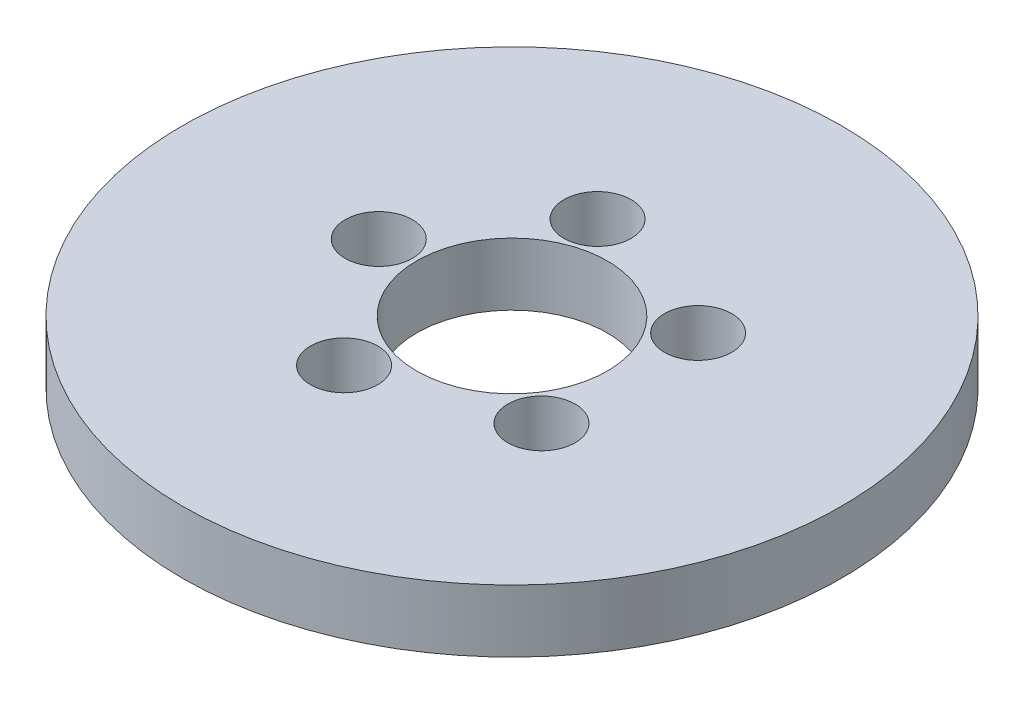
ISO-10303-21;
HEADER;
FILE_DESCRIPTION(('STEP AP214'),'2;1');
FILE_NAME('part.step','',(''),(''),'','','');
FILE_SCHEMA(('AUTOMOTIVE_DESIGN { 1 0 10303 214 1 1 1 1 }'));
ENDSEC;
DATA;
#1=APPLICATION_CONTEXT('core data for automotive mechanical design processes');
#2=APPLICATION_PROTOCOL_DEFINITION('international standard','automotive_design',2000,#1);
#3=PRODUCT_CONTEXT('',#1,'mechanical');
#4=PRODUCT('Part','Part','',(#3));
#5=PRODUCT_RELATED_PRODUCT_CATEGORY('part','',(#4));
#6=PRODUCT_DEFINITION_FORMATION('','',#4);
#7=PRODUCT_DEFINITION_CONTEXT('part definition',#1,'design');
#8=PRODUCT_DEFINITION('design','',#6,#7);
#9=PRODUCT_DEFINITION_SHAPE('','',#8);
#10=(LENGTH_UNIT() NAMED_UNIT(*) SI_UNIT(.MILLI.,.METRE.));
#11=(NAMED_UNIT(*) PLANE_ANGLE_UNIT() SI_UNIT($,.RADIAN.));
#12=(NAMED_UNIT(*) SI_UNIT($,.STERADIAN.) SOLID_ANGLE_UNIT());
#13=UNCERTAINTY_MEASURE_WITH_UNIT(LENGTH_MEASURE(1.E-05),#10,'distance_accuracy_value','');
#14=(GEOMETRIC_REPRESENTATION_CONTEXT(3) GLOBAL_UNCERTAINTY_ASSIGNED_CONTEXT((#13)) GLOBAL_UNIT_ASSIGNED_CONTEXT((#10,
#11,#12)) REPRESENTATION_CONTEXT('',''));
#15=CARTESIAN_POINT('',(0.,0.,0.));
#16=DIRECTION('',(0.,0.,1.));
#17=DIRECTION('',(1.,0.,0.));
#18=AXIS2_PLACEMENT_3D('',#15,#16,#17);
#19=CARTESIAN_POINT('',(0.,18.,0.));
#20=DIRECTION('',(0.,-1.,0.));
#21=DIRECTION('',(0.,0.,-1.));
#22=AXIS2_PLACEMENT_3D('',#19,#20,#21);
#23=CYLINDRICAL_SURFACE('',#22,95.);
#24=CARTESIAN_POINT('',(0.,18.,0.));
#25=DIRECTION('',(0.,1.,0.));
#26=DIRECTION('',(0.,0.,1.));
#27=AXIS2_PLACEMENT_3D('',#24,#25,#26);
#28=CIRCLE('',#27,95.);
#29=CARTESIAN_POINT('',(0.,18.,95.));
#30=VERTEX_POINT('',#29);
#31=EDGE_CURVE('E10',#30,#30,#28,.T.);
#32=ORIENTED_EDGE('',*,*,#31,.F.);
#33=EDGE_LOOP('',(#32));
#34=FACE_BOUND('',#33,.T.);
#35=CARTESIAN_POINT('',(0.,0.,0.));
#36=DIRECTION('',(0.,1.,0.));
#37=DIRECTION('',(0.,0.,1.));
#38=AXIS2_PLACEMENT_3D('',#35,#36,#37);
#39=CIRCLE('',#38,95.);
#40=CARTESIAN_POINT('',(0.,0.,95.));
#41=VERTEX_POINT('',#40);
#42=EDGE_CURVE('E37',#41,#41,#39,.T.);
#43=ORIENTED_EDGE('',*,*,#42,.T.);
#44=EDGE_LOOP('',(#43));
#45=FACE_BOUND('',#44,.T.);
#46=ADVANCED_FACE('F40',(#34,#45),#23,.T.);
#47=CARTESIAN_POINT('',(0.,18.,0.));
#48=DIRECTION('',(0.,1.,0.));
#49=DIRECTION('',(0.,0.,1.));
#50=AXIS2_PLACEMENT_3D('',#47,#48,#49);
#51=PLANE('',#50);
#52=CARTESIAN_POINT('',(-11.8694270788917,18.,-36.5303403164058));
#53=DIRECTION('',(0.,1.,0.));
#54=DIRECTION('',(-0.95105651629515,0.,0.309016994374958));
#55=AXIS2_PLACEMENT_3D('',#52,#53,#54);
#56=CIRCLE('',#55,9.69095283767346);
#57=CARTESIAN_POINT('',(-21.08607092427,18.,-33.5356711978785));
#58=VERTEX_POINT('',#57);
#59=EDGE_CURVE('E70',#58,#58,#56,.T.);
#60=ORIENTED_EDGE('',*,*,#59,.F.);
#61=EDGE_LOOP('',(#60));
#62=FACE_BOUND('',#61,.T.);
#63=CARTESIAN_POINT('',(31.0745635195256,18.,-22.5769919361397));
#64=DIRECTION('',(0.,1.,0.));
#65=DIRECTION('',(-0.58778525229248,0.,-0.809016994374942));
#66=AXIS2_PLACEMENT_3D('',#63,#64,#65);
#67=CIRCLE('',#66,9.69095283767346);
#68=CARTESIAN_POINT('',(25.3783643608792,18.,-30.4171374735036));
#69=VERTEX_POINT('',#68);
#70=EDGE_CURVE('E71',#69,#69,#67,.T.);
#71=ORIENTED_EDGE('',*,*,#70,.F.);
#72=EDGE_LOOP('',(#71));
#73=FACE_BOUND('',#72,.T.);
#74=CARTESIAN_POINT('',(31.0745635195259,18.,22.5769919361393));
#75=DIRECTION('',(0.,1.,0.));
#76=DIRECTION('',(0.587785252292469,0.,-0.809016994374951));
#77=AXIS2_PLACEMENT_3D('',#74,#75,#76);
#78=CIRCLE('',#77,9.69095283767346);
#79=CARTESIAN_POINT('',(36.7707626781722,18.,14.7368463987753));
#80=VERTEX_POINT('',#79);
#81=EDGE_CURVE('E78',#80,#80,#78,.T.);
#82=ORIENTED_EDGE('',*,*,#81,.F.);
#83=EDGE_LOOP('',(#82));
#84=FACE_BOUND('',#83,.T.);
#85=CARTESIAN_POINT('',(-11.8694270788912,18.,36.530340316406));
#86=DIRECTION('',(0.,1.,0.));
#87=DIRECTION('',(0.951056516295155,0.,0.309016994374945));
#88=AXIS2_PLACEMENT_3D('',#85,#86,#87);
#89=CIRCLE('',#88,9.69095283767346);
#90=CARTESIAN_POINT('',(-2.65278323351284,18.,39.5250094349332));
#91=VERTEX_POINT('',#90);
#92=EDGE_CURVE('E61',#91,#91,#89,.T.);
#93=ORIENTED_EDGE('',*,*,#92,.F.);
#94=EDGE_LOOP('',(#93));
#95=FACE_BOUND('',#94,.T.);
#96=CARTESIAN_POINT('',(-38.410272881269,18.,0.));
#97=DIRECTION('',(0.,1.,0.));
#98=DIRECTION('',(0.,0.,1.));
#99=AXIS2_PLACEMENT_3D('',#96,#97,#98);
#100=CIRCLE('',#99,9.69095283767346);
#101=CARTESIAN_POINT('',(-38.410272881269,18.,9.69095283767346));
#102=VERTEX_POINT('',#101);
#103=EDGE_CURVE('E54',#102,#102,#100,.T.);
#104=ORIENTED_EDGE('',*,*,#103,.F.);
#105=EDGE_LOOP('',(#104));
#106=FACE_BOUND('',#105,.T.);
#107=CARTESIAN_POINT('',(0.,18.,0.));
#108=DIRECTION('',(0.,1.,0.));
#109=DIRECTION('',(0.,0.,1.));
#110=AXIS2_PLACEMENT_3D('',#107,#108,#109);
#111=CIRCLE('',#110,27.5);
#112=CARTESIAN_POINT('',(0.,18.,27.5));
#113=VERTEX_POINT('',#112);
#114=EDGE_CURVE('E50',#113,#113,#111,.T.);
#115=ORIENTED_EDGE('',*,*,#114,.F.);
#116=EDGE_LOOP('',(#115));
#117=FACE_BOUND('',#116,.T.);
#118=ORIENTED_EDGE('',*,*,#31,.T.);
#119=EDGE_LOOP('',(#118));
#120=FACE_BOUND('',#119,.T.);
#121=ADVANCED_FACE('F94',(#62,#73,#84,#95,#106,#117,#120),#51,.T.);
#122=CARTESIAN_POINT('',(0.,0.,0.));
#123=DIRECTION('',(0.,1.,0.));
#124=DIRECTION('',(0.,0.,1.));
#125=AXIS2_PLACEMENT_3D('',#122,#123,#124);
#126=PLANE('',#125);
#127=CARTESIAN_POINT('',(0.,0.,0.));
#128=DIRECTION('',(0.,1.,0.));
#129=DIRECTION('',(0.,0.,1.));
#130=AXIS2_PLACEMENT_3D('',#127,#128,#129);
#131=CIRCLE('',#130,27.5);
#132=CARTESIAN_POINT('',(0.,0.,27.5));
#133=VERTEX_POINT('',#132);
#134=EDGE_CURVE('E47',#133,#133,#131,.T.);
#135=ORIENTED_EDGE('',*,*,#134,.T.);
#136=EDGE_LOOP('',(#135));
#137=FACE_BOUND('',#136,.T.);
#138=ORIENTED_EDGE('',*,*,#42,.F.);
#139=EDGE_LOOP('',(#138));
#140=FACE_BOUND('',#139,.T.);
#141=ADVANCED_FACE('F100',(#137,#140),#126,.F.);
#142=CARTESIAN_POINT('',(0.,18.,0.));
#143=DIRECTION('',(0.,-1.,0.));
#144=DIRECTION('',(0.,0.,-1.));
#145=AXIS2_PLACEMENT_3D('',#142,#143,#144);
#146=CYLINDRICAL_SURFACE('',#145,27.5);
#147=ORIENTED_EDGE('',*,*,#114,.T.);
#148=EDGE_LOOP('',(#147));
#149=FACE_BOUND('',#148,.T.);
#150=ORIENTED_EDGE('',*,*,#134,.F.);
#151=EDGE_LOOP('',(#150));
#152=FACE_BOUND('',#151,.T.);
#153=ADVANCED_FACE('F106',(#149,#152),#146,.F.);
#154=CARTESIAN_POINT('',(-38.410272881269,0.922932439283469,0.));
#155=DIRECTION('',(0.,1.,0.));
#156=DIRECTION('',(0.,0.,1.));
#157=AXIS2_PLACEMENT_3D('',#154,#155,#156);
#158=CYLINDRICAL_SURFACE('',#157,9.69095283767346);
#159=CARTESIAN_POINT('',(-38.410272881269,0.922932439283469,0.));
#160=DIRECTION('',(0.,1.,0.));
#161=DIRECTION('',(0.,0.,1.));
#162=AXIS2_PLACEMENT_3D('',#159,#160,#161);
#163=CIRCLE('',#162,9.69095283767346);
#164=CARTESIAN_POINT('',(-38.410272881269,0.922932439283469,9.69095283767346));
#165=VERTEX_POINT('',#164);
#166=EDGE_CURVE('E55',#165,#165,#163,.T.);
#167=ORIENTED_EDGE('',*,*,#166,.F.);
#168=EDGE_LOOP('',(#167));
#169=FACE_BOUND('',#168,.T.);
#170=ORIENTED_EDGE('',*,*,#103,.T.);
#171=EDGE_LOOP('',(#170));
#172=FACE_BOUND('',#171,.T.);
#173=ADVANCED_FACE('F108',(#169,#172),#158,.F.);
#174=CARTESIAN_POINT('',(-38.410272881269,0.922932439283469,0.));
#175=DIRECTION('',(0.,1.,0.));
#176=DIRECTION('',(0.,0.,1.));
#177=AXIS2_PLACEMENT_3D('',#174,#175,#176);
#178=PLANE('',#177);
#179=ORIENTED_EDGE('',*,*,#166,.T.);
#180=EDGE_LOOP('',(#179));
#181=FACE_BOUND('',#180,.T.);
#182=ADVANCED_FACE('F138',(#181),#178,.T.);
#183=CARTESIAN_POINT('',(-11.8694270788912,0.922932439283469,36.530340316406));
#184=DIRECTION('',(0.,1.,0.));
#185=DIRECTION('',(0.,0.,1.));
#186=AXIS2_PLACEMENT_3D('',#183,#184,#185);
#187=CYLINDRICAL_SURFACE('',#186,9.69095283767346);
#188=CARTESIAN_POINT('',(-11.8694270788912,0.922932439283469,36.530340316406));
#189=DIRECTION('',(0.,1.,0.));
#190=DIRECTION('',(0.951056516295155,0.,0.309016994374945));
#191=AXIS2_PLACEMENT_3D('',#188,#189,#190);
#192=CIRCLE('',#191,9.69095283767346);
#193=CARTESIAN_POINT('',(-2.65278323351284,0.922932439283469,39.5250094349332));
#194=VERTEX_POINT('',#193);
#195=EDGE_CURVE('E59',#194,#194,#192,.T.);
#196=ORIENTED_EDGE('',*,*,#195,.F.);
#197=EDGE_LOOP('',(#196));
#198=FACE_BOUND('',#197,.T.);
#199=ORIENTED_EDGE('',*,*,#92,.T.);
#200=EDGE_LOOP('',(#199));
#201=FACE_BOUND('',#200,.T.);
#202=ADVANCED_FACE('F150',(#198,#201),#187,.F.);
#203=CARTESIAN_POINT('',(-11.8694270788912,0.922932439283469,36.530340316406));
#204=DIRECTION('',(0.,1.,0.));
#205=DIRECTION('',(0.951056516295155,0.,0.309016994374945));
#206=AXIS2_PLACEMENT_3D('',#203,#204,#205);
#207=PLANE('',#206);
#208=ORIENTED_EDGE('',*,*,#195,.T.);
#209=EDGE_LOOP('',(#208));
#210=FACE_BOUND('',#209,.T.);
#211=ADVANCED_FACE('F89',(#210),#207,.T.);
#212=CARTESIAN_POINT('',(31.0745635195259,0.922932439283469,22.5769919361393));
#213=DIRECTION('',(0.,1.,0.));
#214=DIRECTION('',(0.,0.,1.));
#215=AXIS2_PLACEMENT_3D('',#212,#213,#214);
#216=CYLINDRICAL_SURFACE('',#215,9.69095283767346);
#217=CARTESIAN_POINT('',(31.0745635195259,0.922932439283469,22.5769919361393));
#218=DIRECTION('',(0.,1.,0.));
#219=DIRECTION('',(0.587785252292469,0.,-0.809016994374951));
#220=AXIS2_PLACEMENT_3D('',#217,#218,#219);
#221=CIRCLE('',#220,9.69095283767346);
#222=CARTESIAN_POINT('',(36.7707626781722,0.922932439283469,14.7368463987753));
#223=VERTEX_POINT('',#222);
#224=EDGE_CURVE('E63',#223,#223,#221,.T.);
#225=ORIENTED_EDGE('',*,*,#224,.F.);
#226=EDGE_LOOP('',(#225));
#227=FACE_BOUND('',#226,.T.);
#228=ORIENTED_EDGE('',*,*,#81,.T.);
#229=EDGE_LOOP('',(#228));
#230=FACE_BOUND('',#229,.T.);
#231=ADVANCED_FACE('F87',(#227,#230),#216,.F.);
#232=CARTESIAN_POINT('',(31.0745635195259,0.922932439283469,22.5769919361393));
#233=DIRECTION('',(0.,1.,0.));
#234=DIRECTION('',(0.587785252292469,0.,-0.809016994374951));
#235=AXIS2_PLACEMENT_3D('',#232,#233,#234);
#236=PLANE('',#235);
#237=ORIENTED_EDGE('',*,*,#224,.T.);
#238=EDGE_LOOP('',(#237));
#239=FACE_BOUND('',#238,.T.);
#240=ADVANCED_FACE('F84',(#239),#236,.T.);
#241=CARTESIAN_POINT('',(31.0745635195256,0.922932439283469,-22.5769919361397));
#242=DIRECTION('',(0.,1.,0.));
#243=DIRECTION('',(0.,0.,1.));
#244=AXIS2_PLACEMENT_3D('',#241,#242,#243);
#245=CYLINDRICAL_SURFACE('',#244,9.69095283767346);
#246=CARTESIAN_POINT('',(31.0745635195256,0.922932439283469,-22.5769919361397));
#247=DIRECTION('',(0.,1.,0.));
#248=DIRECTION('',(-0.58778525229248,0.,-0.809016994374942));
#249=AXIS2_PLACEMENT_3D('',#246,#247,#248);
#250=CIRCLE('',#249,9.69095283767346);
#251=CARTESIAN_POINT('',(25.3783643608792,0.922932439283469,-30.4171374735036));
#252=VERTEX_POINT('',#251);
#253=EDGE_CURVE('E76',#252,#252,#250,.T.);
#254=ORIENTED_EDGE('',*,*,#253,.F.);
#255=EDGE_LOOP('',(#254));
#256=FACE_BOUND('',#255,.T.);
#257=ORIENTED_EDGE('',*,*,#70,.T.);
#258=EDGE_LOOP('',(#257));
#259=FACE_BOUND('',#258,.T.);
#260=ADVANCED_FACE('F185',(#256,#259),#245,.F.);
#261=CARTESIAN_POINT('',(31.0745635195256,0.922932439283469,-22.5769919361397));
#262=DIRECTION('',(0.,1.,0.));
#263=DIRECTION('',(-0.58778525229248,0.,-0.809016994374942));
#264=AXIS2_PLACEMENT_3D('',#261,#262,#263);
#265=PLANE('',#264);
#266=ORIENTED_EDGE('',*,*,#253,.T.);
#267=EDGE_LOOP('',(#266));
#268=FACE_BOUND('',#267,.T.);
#269=ADVANCED_FACE('F189',(#268),#265,.T.);
#270=CARTESIAN_POINT('',(-11.8694270788917,0.922932439283469,-36.5303403164058));
#271=DIRECTION('',(0.,1.,0.));
#272=DIRECTION('',(0.,0.,1.));
#273=AXIS2_PLACEMENT_3D('',#270,#271,#272);
#274=CYLINDRICAL_SURFACE('',#273,9.69095283767346);
#275=CARTESIAN_POINT('',(-11.8694270788917,0.922932439283469,-36.5303403164058));
#276=DIRECTION('',(0.,1.,0.));
#277=DIRECTION('',(-0.95105651629515,0.,0.309016994374958));
#278=AXIS2_PLACEMENT_3D('',#275,#276,#277);
#279=CIRCLE('',#278,9.69095283767346);
#280=CARTESIAN_POINT('',(-21.08607092427,0.922932439283469,-33.5356711978785));
#281=VERTEX_POINT('',#280);
#282=EDGE_CURVE('E69',#281,#281,#279,.T.);
#283=ORIENTED_EDGE('',*,*,#282,.F.);
#284=EDGE_LOOP('',(#283));
#285=FACE_BOUND('',#284,.T.);
#286=ORIENTED_EDGE('',*,*,#59,.T.);
#287=EDGE_LOOP('',(#286));
#288=FACE_BOUND('',#287,.T.);
#289=ADVANCED_FACE('F200',(#285,#288),#274,.F.);
#290=CARTESIAN_POINT('',(-11.8694270788917,0.922932439283469,-36.5303403164058));
#291=DIRECTION('',(0.,1.,0.));
#292=DIRECTION('',(-0.95105651629515,0.,0.309016994374958));
#293=AXIS2_PLACEMENT_3D('',#290,#291,#292);
#294=PLANE('',#293);
#295=ORIENTED_EDGE('',*,*,#282,.T.);
#296=EDGE_LOOP('',(#295));
#297=FACE_BOUND('',#296,.T.);
#298=ADVANCED_FACE('F208',(#297),#294,.T.);
#299=CLOSED_SHELL('',(#46,#121,#141,#153,#173,#182,#202,#211,#231,#240,#260,#269,#289,#298));
#300=MANIFOLD_SOLID_BREP('B2',#299);
#301=ADVANCED_BREP_SHAPE_REPRESENTATION('',(#18,#300),#14);
#302=SHAPE_DEFINITION_REPRESENTATION(#9,#301);
ENDSEC;
END-ISO-10303-21;
